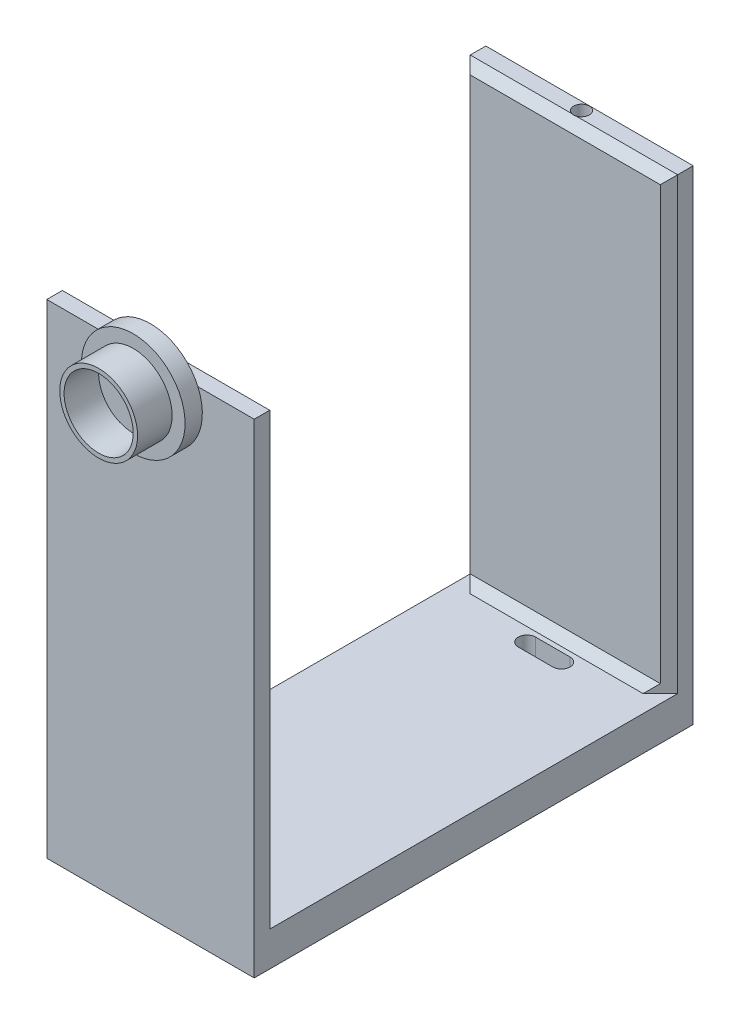
ISO-10303-21;
HEADER;
FILE_DESCRIPTION(('STEP AP214'),'2;1');
FILE_NAME('part.step','',(''),(''),'','','');
FILE_SCHEMA(('AUTOMOTIVE_DESIGN { 1 0 10303 214 1 1 1 1 }'));
ENDSEC;
DATA;
#1=APPLICATION_CONTEXT('core data for automotive mechanical design processes');
#2=APPLICATION_PROTOCOL_DEFINITION('international standard','automotive_design',2000,#1);
#3=PRODUCT_CONTEXT('',#1,'mechanical');
#4=PRODUCT('Part','Part','',(#3));
#5=PRODUCT_RELATED_PRODUCT_CATEGORY('part','',(#4));
#6=PRODUCT_DEFINITION_FORMATION('','',#4);
#7=PRODUCT_DEFINITION_CONTEXT('part definition',#1,'design');
#8=PRODUCT_DEFINITION('design','',#6,#7);
#9=PRODUCT_DEFINITION_SHAPE('','',#8);
#10=(LENGTH_UNIT() NAMED_UNIT(*) SI_UNIT(.MILLI.,.METRE.));
#11=(NAMED_UNIT(*) PLANE_ANGLE_UNIT() SI_UNIT($,.RADIAN.));
#12=(NAMED_UNIT(*) SI_UNIT($,.STERADIAN.) SOLID_ANGLE_UNIT());
#13=UNCERTAINTY_MEASURE_WITH_UNIT(LENGTH_MEASURE(1.E-05),#10,'distance_accuracy_value','');
#14=(GEOMETRIC_REPRESENTATION_CONTEXT(3) GLOBAL_UNCERTAINTY_ASSIGNED_CONTEXT((#13)) GLOBAL_UNIT_ASSIGNED_CONTEXT((#10,
#11,#12)) REPRESENTATION_CONTEXT('',''));
#15=CARTESIAN_POINT('',(0.,0.,0.));
#16=DIRECTION('',(0.,0.,1.));
#17=DIRECTION('',(1.,0.,0.));
#18=AXIS2_PLACEMENT_3D('',#15,#16,#17);
#19=CARTESIAN_POINT('',(6.,-2.,0.));
#20=DIRECTION('',(1.,0.,0.));
#21=DIRECTION('',(0.,0.,-1.));
#22=AXIS2_PLACEMENT_3D('',#19,#20,#21);
#23=PLANE('',#22);
#24=DIRECTION('',(0.,0.,1.));
#25=VECTOR('',#24,1.);
#26=CARTESIAN_POINT('',(6.,26.,-12.7));
#27=LINE('',#26,#25);
#28=CARTESIAN_POINT('',(6.,26.,-12.7));
#29=VERTEX_POINT('',#28);
#30=CARTESIAN_POINT('',(6.,26.,-11.8));
#31=VERTEX_POINT('',#30);
#32=EDGE_CURVE('E309',#29,#31,#27,.T.);
#33=ORIENTED_EDGE('',*,*,#32,.T.);
#34=DIRECTION('',(0.,-1.,0.));
#35=VECTOR('',#34,1.);
#36=CARTESIAN_POINT('',(6.,-2.,-11.8));
#37=LINE('',#36,#35);
#38=CARTESIAN_POINT('',(6.,0.,-11.8));
#39=VERTEX_POINT('',#38);
#40=EDGE_CURVE('E360',#31,#39,#37,.T.);
#41=ORIENTED_EDGE('',*,*,#40,.T.);
#42=DIRECTION('',(0.,0.,-1.));
#43=VECTOR('',#42,1.);
#44=CARTESIAN_POINT('',(6.,0.,0.));
#45=LINE('',#44,#43);
#46=CARTESIAN_POINT('',(6.,0.,11.8));
#47=VERTEX_POINT('',#46);
#48=EDGE_CURVE('E327',#47,#39,#45,.T.);
#49=ORIENTED_EDGE('',*,*,#48,.F.);
#50=DIRECTION('',(0.,1.,0.));
#51=VECTOR('',#50,1.);
#52=CARTESIAN_POINT('',(6.,26.,11.8));
#53=LINE('',#52,#51);
#54=CARTESIAN_POINT('',(6.,26.,11.8));
#55=VERTEX_POINT('',#54);
#56=EDGE_CURVE('E358',#47,#55,#53,.T.);
#57=ORIENTED_EDGE('',*,*,#56,.T.);
#58=DIRECTION('',(0.,0.,-1.));
#59=VECTOR('',#58,1.);
#60=CARTESIAN_POINT('',(6.,26.,12.7));
#61=LINE('',#60,#59);
#62=CARTESIAN_POINT('',(6.,26.,12.7));
#63=VERTEX_POINT('',#62);
#64=EDGE_CURVE('E325',#63,#55,#61,.T.);
#65=ORIENTED_EDGE('',*,*,#64,.F.);
#66=DIRECTION('',(0.,1.,0.));
#67=VECTOR('',#66,1.);
#68=CARTESIAN_POINT('',(6.,-2.,12.7));
#69=LINE('',#68,#67);
#70=CARTESIAN_POINT('',(6.,-2.,12.7));
#71=VERTEX_POINT('',#70);
#72=EDGE_CURVE('E218',#71,#63,#69,.T.);
#73=ORIENTED_EDGE('',*,*,#72,.F.);
#74=DIRECTION('',(0.,0.,-1.));
#75=VECTOR('',#74,1.);
#76=CARTESIAN_POINT('',(6.,-2.,0.));
#77=LINE('',#76,#75);
#78=CARTESIAN_POINT('',(6.,-2.,-12.7));
#79=VERTEX_POINT('',#78);
#80=EDGE_CURVE('E328',#71,#79,#77,.T.);
#81=ORIENTED_EDGE('',*,*,#80,.T.);
#82=DIRECTION('',(0.,1.,0.));
#83=VECTOR('',#82,1.);
#84=CARTESIAN_POINT('',(6.,-2.,-12.7));
#85=LINE('',#84,#83);
#86=EDGE_CURVE('E319',#79,#29,#85,.T.);
#87=ORIENTED_EDGE('',*,*,#86,.T.);
#88=EDGE_LOOP('',(#33,#41,#49,#57,#65,#73,#81,#87));
#89=FACE_BOUND('',#88,.T.);
#90=ADVANCED_FACE('F35',(#89),#23,.T.);
#91=CARTESIAN_POINT('',(-6.,-2.,12.7));
#92=DIRECTION('',(0.,0.,1.));
#93=DIRECTION('',(1.,0.,0.));
#94=AXIS2_PLACEMENT_3D('',#91,#92,#93);
#95=PLANE('',#94);
#96=CARTESIAN_POINT('',(0.,24.7857669326883,12.7));
#97=DIRECTION('',(0.,0.,1.));
#98=DIRECTION('',(1.,0.,0.));
#99=AXIS2_PLACEMENT_3D('',#96,#97,#98);
#100=CIRCLE('',#99,3.);
#101=CARTESIAN_POINT('',(-2.74328964169785,26.,12.7));
#102=VERTEX_POINT('',#101);
#103=CARTESIAN_POINT('',(2.74328964169785,26.,12.7));
#104=VERTEX_POINT('',#103);
#105=EDGE_CURVE('E45',#102,#104,#100,.T.);
#106=ORIENTED_EDGE('',*,*,#105,.F.);
#107=DIRECTION('',(1.,0.,0.));
#108=VECTOR('',#107,1.);
#109=CARTESIAN_POINT('',(-6.,26.,12.7));
#110=LINE('',#109,#108);
#111=CARTESIAN_POINT('',(-6.,26.,12.7));
#112=VERTEX_POINT('',#111);
#113=EDGE_CURVE('E211',#112,#102,#110,.T.);
#114=ORIENTED_EDGE('',*,*,#113,.F.);
#115=DIRECTION('',(0.,1.,0.));
#116=VECTOR('',#115,1.);
#117=CARTESIAN_POINT('',(-6.,-2.,12.7));
#118=LINE('',#117,#116);
#119=CARTESIAN_POINT('',(-6.,-2.,12.7));
#120=VERTEX_POINT('',#119);
#121=EDGE_CURVE('E336',#120,#112,#118,.T.);
#122=ORIENTED_EDGE('',*,*,#121,.F.);
#123=DIRECTION('',(1.,0.,0.));
#124=VECTOR('',#123,1.);
#125=CARTESIAN_POINT('',(-6.,-2.,12.7));
#126=LINE('',#125,#124);
#127=EDGE_CURVE('E334',#120,#71,#126,.T.);
#128=ORIENTED_EDGE('',*,*,#127,.T.);
#129=ORIENTED_EDGE('',*,*,#72,.T.);
#130=EDGE_CURVE('E209',#104,#63,#110,.T.);
#131=ORIENTED_EDGE('',*,*,#130,.F.);
#132=EDGE_LOOP('',(#106,#114,#122,#128,#129,#131));
#133=FACE_BOUND('',#132,.T.);
#134=ADVANCED_FACE('F216',(#133),#95,.T.);
#135=CARTESIAN_POINT('',(-6.,-2.,0.));
#136=DIRECTION('',(-1.,0.,0.));
#137=DIRECTION('',(0.,0.,1.));
#138=AXIS2_PLACEMENT_3D('',#135,#136,#137);
#139=PLANE('',#138);
#140=DIRECTION('',(0.,0.,1.));
#141=VECTOR('',#140,1.);
#142=CARTESIAN_POINT('',(-6.,0.,0.));
#143=LINE('',#142,#141);
#144=CARTESIAN_POINT('',(-6.,0.,-11.8));
#145=VERTEX_POINT('',#144);
#146=CARTESIAN_POINT('',(-6.,0.,11.8));
#147=VERTEX_POINT('',#146);
#148=EDGE_CURVE('E331',#145,#147,#143,.T.);
#149=ORIENTED_EDGE('',*,*,#148,.F.);
#150=DIRECTION('',(0.,1.,0.));
#151=VECTOR('',#150,1.);
#152=CARTESIAN_POINT('',(-6.,-2.,-11.8));
#153=LINE('',#152,#151);
#154=CARTESIAN_POINT('',(-6.,26.,-11.8));
#155=VERTEX_POINT('',#154);
#156=EDGE_CURVE('E352',#145,#155,#153,.T.);
#157=ORIENTED_EDGE('',*,*,#156,.T.);
#158=DIRECTION('',(0.,0.,-1.));
#159=VECTOR('',#158,1.);
#160=CARTESIAN_POINT('',(-6.,26.,-12.7));
#161=LINE('',#160,#159);
#162=CARTESIAN_POINT('',(-6.,26.,-12.7));
#163=VERTEX_POINT('',#162);
#164=EDGE_CURVE('E307',#155,#163,#161,.T.);
#165=ORIENTED_EDGE('',*,*,#164,.T.);
#166=DIRECTION('',(0.,1.,0.));
#167=VECTOR('',#166,1.);
#168=CARTESIAN_POINT('',(-6.,-2.,-12.7));
#169=LINE('',#168,#167);
#170=CARTESIAN_POINT('',(-6.,-2.,-12.7));
#171=VERTEX_POINT('',#170);
#172=EDGE_CURVE('E320',#171,#163,#169,.T.);
#173=ORIENTED_EDGE('',*,*,#172,.F.);
#174=DIRECTION('',(0.,0.,1.));
#175=VECTOR('',#174,1.);
#176=CARTESIAN_POINT('',(-6.,-2.,0.));
#177=LINE('',#176,#175);
#178=EDGE_CURVE('E330',#171,#120,#177,.T.);
#179=ORIENTED_EDGE('',*,*,#178,.T.);
#180=ORIENTED_EDGE('',*,*,#121,.T.);
#181=DIRECTION('',(0.,0.,1.));
#182=VECTOR('',#181,1.);
#183=CARTESIAN_POINT('',(-6.,26.,12.7));
#184=LINE('',#183,#182);
#185=CARTESIAN_POINT('',(-6.,26.,11.8));
#186=VERTEX_POINT('',#185);
#187=EDGE_CURVE('E220',#186,#112,#184,.T.);
#188=ORIENTED_EDGE('',*,*,#187,.F.);
#189=DIRECTION('',(0.,-1.,0.));
#190=VECTOR('',#189,1.);
#191=CARTESIAN_POINT('',(-6.,0.,11.8));
#192=LINE('',#191,#190);
#193=EDGE_CURVE('E349',#186,#147,#192,.T.);
#194=ORIENTED_EDGE('',*,*,#193,.T.);
#195=EDGE_LOOP('',(#149,#157,#165,#173,#179,#180,#188,#194));
#196=FACE_BOUND('',#195,.T.);
#197=ADVANCED_FACE('F447',(#196),#139,.T.);
#198=CARTESIAN_POINT('',(0.,-2.,0.));
#199=DIRECTION('',(0.,1.,0.));
#200=DIRECTION('',(0.,0.,1.));
#201=AXIS2_PLACEMENT_3D('',#198,#199,#200);
#202=PLANE('',#201);
#203=DIRECTION('',(-1.,0.,0.));
#204=VECTOR('',#203,1.);
#205=CARTESIAN_POINT('',(0.,-2.,-10.523894151716));
#206=LINE('',#205,#204);
#207=CARTESIAN_POINT('',(1.0560950117039,-2.,-10.523894151716));
#208=VERTEX_POINT('',#207);
#209=CARTESIAN_POINT('',(-0.944927115735066,-2.,-10.523894151716));
#210=VERTEX_POINT('',#209);
#211=EDGE_CURVE('E290',#208,#210,#206,.T.);
#212=ORIENTED_EDGE('',*,*,#211,.T.);
#213=CARTESIAN_POINT('',(-0.944927115735066,-2.,-10.023894151716));
#214=DIRECTION('',(0.,1.,0.));
#215=DIRECTION('',(0.,0.,1.));
#216=AXIS2_PLACEMENT_3D('',#213,#214,#215);
#217=CIRCLE('',#216,0.5);
#218=CARTESIAN_POINT('',(-0.944927115735066,-2.,-9.52389415171596));
#219=VERTEX_POINT('',#218);
#220=EDGE_CURVE('E293',#210,#219,#217,.T.);
#221=ORIENTED_EDGE('',*,*,#220,.T.);
#222=DIRECTION('',(1.,0.,0.));
#223=VECTOR('',#222,1.);
#224=CARTESIAN_POINT('',(0.,-2.,-9.52389415171596));
#225=LINE('',#224,#223);
#226=CARTESIAN_POINT('',(1.0560950117039,-2.,-9.52389415171596));
#227=VERTEX_POINT('',#226);
#228=EDGE_CURVE('E284',#219,#227,#225,.T.);
#229=ORIENTED_EDGE('',*,*,#228,.T.);
#230=CARTESIAN_POINT('',(1.0560950117039,-2.,-10.023894151716));
#231=DIRECTION('',(0.,1.,0.));
#232=DIRECTION('',(0.,0.,1.));
#233=AXIS2_PLACEMENT_3D('',#230,#231,#232);
#234=CIRCLE('',#233,0.5);
#235=EDGE_CURVE('E287',#227,#208,#234,.T.);
#236=ORIENTED_EDGE('',*,*,#235,.T.);
#237=EDGE_LOOP('',(#212,#221,#229,#236));
#238=FACE_BOUND('',#237,.T.);
#239=DIRECTION('',(-1.,0.,0.));
#240=VECTOR('',#239,1.);
#241=CARTESIAN_POINT('',(0.,-2.,9.52389415171596));
#242=LINE('',#241,#240);
#243=CARTESIAN_POINT('',(1.0560950117039,-2.,9.52389415171596));
#244=VERTEX_POINT('',#243);
#245=CARTESIAN_POINT('',(-0.944927115735066,-2.,9.52389415171596));
#246=VERTEX_POINT('',#245);
#247=EDGE_CURVE('E278',#244,#246,#242,.T.);
#248=ORIENTED_EDGE('',*,*,#247,.T.);
#249=CARTESIAN_POINT('',(-0.944927115735066,-2.,10.023894151716));
#250=DIRECTION('',(0.,1.,0.));
#251=DIRECTION('',(0.,0.,1.));
#252=AXIS2_PLACEMENT_3D('',#249,#250,#251);
#253=CIRCLE('',#252,0.5);
#254=CARTESIAN_POINT('',(-0.944927115735066,-2.,10.523894151716));
#255=VERTEX_POINT('',#254);
#256=EDGE_CURVE('E281',#246,#255,#253,.T.);
#257=ORIENTED_EDGE('',*,*,#256,.T.);
#258=DIRECTION('',(1.,0.,0.));
#259=VECTOR('',#258,1.);
#260=CARTESIAN_POINT('',(0.,-2.,10.523894151716));
#261=LINE('',#260,#259);
#262=CARTESIAN_POINT('',(1.0560950117039,-2.,10.523894151716));
#263=VERTEX_POINT('',#262);
#264=EDGE_CURVE('E249',#255,#263,#261,.T.);
#265=ORIENTED_EDGE('',*,*,#264,.T.);
#266=CARTESIAN_POINT('',(1.0560950117039,-2.,10.023894151716));
#267=DIRECTION('',(0.,1.,0.));
#268=DIRECTION('',(0.,0.,1.));
#269=AXIS2_PLACEMENT_3D('',#266,#267,#268);
#270=CIRCLE('',#269,0.5);
#271=EDGE_CURVE('E275',#263,#244,#270,.T.);
#272=ORIENTED_EDGE('',*,*,#271,.T.);
#273=EDGE_LOOP('',(#248,#257,#265,#272));
#274=FACE_BOUND('',#273,.T.);
#275=ORIENTED_EDGE('',*,*,#80,.F.);
#276=ORIENTED_EDGE('',*,*,#127,.F.);
#277=ORIENTED_EDGE('',*,*,#178,.F.);
#278=DIRECTION('',(1.,0.,0.));
#279=VECTOR('',#278,1.);
#280=CARTESIAN_POINT('',(-6.,-2.,-12.7));
#281=LINE('',#280,#279);
#282=EDGE_CURVE('E316',#171,#79,#281,.T.);
#283=ORIENTED_EDGE('',*,*,#282,.T.);
#284=EDGE_LOOP('',(#275,#276,#277,#283));
#285=FACE_BOUND('',#284,.T.);
#286=ADVANCED_FACE('F492',(#238,#274,#285),#202,.F.);
#287=CARTESIAN_POINT('',(0.,0.,0.));
#288=DIRECTION('',(0.,1.,0.));
#289=DIRECTION('',(0.,0.,1.));
#290=AXIS2_PLACEMENT_3D('',#287,#288,#289);
#291=PLANE('',#290);
#292=CARTESIAN_POINT('',(-0.944927115735066,0.,-10.023894151716));
#293=DIRECTION('',(0.,1.,0.));
#294=DIRECTION('',(0.,0.,1.));
#295=AXIS2_PLACEMENT_3D('',#292,#293,#294);
#296=CIRCLE('',#295,0.5);
#297=CARTESIAN_POINT('',(-0.944927115735066,0.,-10.523894151716));
#298=VERTEX_POINT('',#297);
#299=CARTESIAN_POINT('',(-0.944927115735066,0.,-9.52389415171596));
#300=VERTEX_POINT('',#299);
#301=EDGE_CURVE('E235',#298,#300,#296,.T.);
#302=ORIENTED_EDGE('',*,*,#301,.F.);
#303=DIRECTION('',(-1.,0.,0.));
#304=VECTOR('',#303,1.);
#305=CARTESIAN_POINT('',(-0.944927115735066,0.,-10.523894151716));
#306=LINE('',#305,#304);
#307=CARTESIAN_POINT('',(1.0560950117039,0.,-10.523894151716));
#308=VERTEX_POINT('',#307);
#309=EDGE_CURVE('E243',#308,#298,#306,.T.);
#310=ORIENTED_EDGE('',*,*,#309,.F.);
#311=CARTESIAN_POINT('',(1.0560950117039,0.,-10.023894151716));
#312=DIRECTION('',(0.,1.,0.));
#313=DIRECTION('',(0.,0.,1.));
#314=AXIS2_PLACEMENT_3D('',#311,#312,#313);
#315=CIRCLE('',#314,0.5);
#316=CARTESIAN_POINT('',(1.0560950117039,0.,-9.52389415171596));
#317=VERTEX_POINT('',#316);
#318=EDGE_CURVE('E240',#317,#308,#315,.T.);
#319=ORIENTED_EDGE('',*,*,#318,.F.);
#320=DIRECTION('',(1.,0.,0.));
#321=VECTOR('',#320,1.);
#322=CARTESIAN_POINT('',(-0.944927115735066,0.,-9.52389415171596));
#323=LINE('',#322,#321);
#324=EDGE_CURVE('E237',#300,#317,#323,.T.);
#325=ORIENTED_EDGE('',*,*,#324,.F.);
#326=EDGE_LOOP('',(#302,#310,#319,#325));
#327=FACE_BOUND('',#326,.T.);
#328=CARTESIAN_POINT('',(-0.944927115735066,0.,10.023894151716));
#329=DIRECTION('',(0.,1.,0.));
#330=DIRECTION('',(0.,0.,-1.));
#331=AXIS2_PLACEMENT_3D('',#328,#329,#330);
#332=CIRCLE('',#331,0.5);
#333=CARTESIAN_POINT('',(-0.944927115735066,0.,9.52389415171596));
#334=VERTEX_POINT('',#333);
#335=CARTESIAN_POINT('',(-0.944927115735066,0.,10.523894151716));
#336=VERTEX_POINT('',#335);
#337=EDGE_CURVE('E229',#334,#336,#332,.T.);
#338=ORIENTED_EDGE('',*,*,#337,.F.);
#339=DIRECTION('',(-1.,0.,0.));
#340=VECTOR('',#339,1.);
#341=CARTESIAN_POINT('',(-0.944927115735066,0.,9.52389415171596));
#342=LINE('',#341,#340);
#343=CARTESIAN_POINT('',(1.0560950117039,0.,9.52389415171596));
#344=VERTEX_POINT('',#343);
#345=EDGE_CURVE('E262',#344,#334,#342,.T.);
#346=ORIENTED_EDGE('',*,*,#345,.F.);
#347=CARTESIAN_POINT('',(1.0560950117039,0.,10.023894151716));
#348=DIRECTION('',(0.,1.,0.));
#349=DIRECTION('',(0.,0.,-1.));
#350=AXIS2_PLACEMENT_3D('',#347,#348,#349);
#351=CIRCLE('',#350,0.5);
#352=CARTESIAN_POINT('',(1.0560950117039,0.,10.523894151716));
#353=VERTEX_POINT('',#352);
#354=EDGE_CURVE('E259',#353,#344,#351,.T.);
#355=ORIENTED_EDGE('',*,*,#354,.F.);
#356=DIRECTION('',(1.,0.,0.));
#357=VECTOR('',#356,1.);
#358=CARTESIAN_POINT('',(-0.944927115735066,0.,10.523894151716));
#359=LINE('',#358,#357);
#360=EDGE_CURVE('E256',#336,#353,#359,.T.);
#361=ORIENTED_EDGE('',*,*,#360,.F.);
#362=EDGE_LOOP('',(#338,#346,#355,#361));
#363=FACE_BOUND('',#362,.T.);
#364=DIRECTION('',(0.70710678118655,0.,-0.707106781186545));
#365=VECTOR('',#364,1.);
#366=CARTESIAN_POINT('',(-6.,0.,11.8));
#367=LINE('',#366,#365);
#368=CARTESIAN_POINT('',(-4.99999999999999,0.,10.8));
#369=VERTEX_POINT('',#368);
#370=EDGE_CURVE('E381',#147,#369,#367,.T.);
#371=ORIENTED_EDGE('',*,*,#370,.T.);
#372=DIRECTION('',(1.,0.,0.));
#373=VECTOR('',#372,1.);
#374=CARTESIAN_POINT('',(0.,0.,10.8));
#375=LINE('',#374,#373);
#376=CARTESIAN_POINT('',(4.99999999999999,0.,10.8));
#377=VERTEX_POINT('',#376);
#378=EDGE_CURVE('E399',#369,#377,#375,.T.);
#379=ORIENTED_EDGE('',*,*,#378,.T.);
#380=DIRECTION('',(0.70710678118655,0.,0.707106781186545));
#381=VECTOR('',#380,1.);
#382=CARTESIAN_POINT('',(5.49999999999999,0.,11.3));
#383=LINE('',#382,#381);
#384=EDGE_CURVE('E378',#377,#47,#383,.T.);
#385=ORIENTED_EDGE('',*,*,#384,.T.);
#386=ORIENTED_EDGE('',*,*,#48,.T.);
#387=DIRECTION('',(0.70710678118655,0.,-0.707106781186545));
#388=VECTOR('',#387,1.);
#389=CARTESIAN_POINT('',(6.,0.,-11.8));
#390=LINE('',#389,#388);
#391=CARTESIAN_POINT('',(4.99999999999999,0.,-10.8));
#392=VERTEX_POINT('',#391);
#393=EDGE_CURVE('E376',#39,#392,#390,.F.);
#394=ORIENTED_EDGE('',*,*,#393,.T.);
#395=DIRECTION('',(-1.,0.,0.));
#396=VECTOR('',#395,1.);
#397=CARTESIAN_POINT('',(-5.5,0.,-10.8));
#398=LINE('',#397,#396);
#399=CARTESIAN_POINT('',(-4.99999999999999,0.,-10.8));
#400=VERTEX_POINT('',#399);
#401=EDGE_CURVE('E396',#392,#400,#398,.T.);
#402=ORIENTED_EDGE('',*,*,#401,.T.);
#403=DIRECTION('',(0.70710678118655,0.,0.707106781186545));
#404=VECTOR('',#403,1.);
#405=CARTESIAN_POINT('',(-5.5,0.,-11.3));
#406=LINE('',#405,#404);
#407=EDGE_CURVE('E373',#400,#145,#406,.F.);
#408=ORIENTED_EDGE('',*,*,#407,.T.);
#409=ORIENTED_EDGE('',*,*,#148,.T.);
#410=EDGE_LOOP('',(#371,#379,#385,#386,#394,#402,#408,#409));
#411=FACE_BOUND('',#410,.T.);
#412=ADVANCED_FACE('F460',(#327,#363,#411),#291,.T.);
#413=CARTESIAN_POINT('',(-6.,26.,11.3));
#414=DIRECTION('',(0.,0.,1.));
#415=DIRECTION('',(1.,0.,0.));
#416=AXIS2_PLACEMENT_3D('',#413,#414,#415);
#417=PLANE('',#416);
#418=DIRECTION('',(0.,-1.,0.));
#419=VECTOR('',#418,1.);
#420=CARTESIAN_POINT('',(5.49999999999999,0.,11.3));
#421=LINE('',#420,#419);
#422=CARTESIAN_POINT('',(5.49999999999999,25.5,11.3));
#423=VERTEX_POINT('',#422);
#424=CARTESIAN_POINT('',(5.49999999999999,0.5,11.3));
#425=VERTEX_POINT('',#424);
#426=EDGE_CURVE('E367',#423,#425,#421,.T.);
#427=ORIENTED_EDGE('',*,*,#426,.T.);
#428=DIRECTION('',(-1.,0.,0.));
#429=VECTOR('',#428,1.);
#430=CARTESIAN_POINT('',(-6.,0.5,11.3));
#431=LINE('',#430,#429);
#432=CARTESIAN_POINT('',(-5.49999999999999,0.5,11.3));
#433=VERTEX_POINT('',#432);
#434=EDGE_CURVE('E383',#425,#433,#431,.T.);
#435=ORIENTED_EDGE('',*,*,#434,.T.);
#436=DIRECTION('',(0.,1.,0.));
#437=VECTOR('',#436,1.);
#438=CARTESIAN_POINT('',(-5.49999999999999,26.,11.3));
#439=LINE('',#438,#437);
#440=CARTESIAN_POINT('',(-5.49999999999999,25.5,11.3));
#441=VERTEX_POINT('',#440);
#442=EDGE_CURVE('E363',#433,#441,#439,.T.);
#443=ORIENTED_EDGE('',*,*,#442,.T.);
#444=DIRECTION('',(1.,0.,0.));
#445=VECTOR('',#444,1.);
#446=CARTESIAN_POINT('',(-6.,25.5,11.3));
#447=LINE('',#446,#445);
#448=EDGE_CURVE('E365',#441,#423,#447,.T.);
#449=ORIENTED_EDGE('',*,*,#448,.T.);
#450=EDGE_LOOP('',(#427,#435,#443,#449));
#451=FACE_BOUND('',#450,.T.);
#452=ADVANCED_FACE('F484',(#451),#417,.F.);
#453=CARTESIAN_POINT('',(0.,26.,0.));
#454=DIRECTION('',(0.,-1.,0.));
#455=DIRECTION('',(0.,0.,-1.));
#456=AXIS2_PLACEMENT_3D('',#453,#454,#455);
#457=PLANE('',#456);
#458=DIRECTION('',(-1.,0.,0.));
#459=VECTOR('',#458,1.);
#460=CARTESIAN_POINT('',(0.,26.,11.8));
#461=LINE('',#460,#459);
#462=CARTESIAN_POINT('',(0.105569353476005,26.,11.8));
#463=VERTEX_POINT('',#462);
#464=EDGE_CURVE('E371',#55,#463,#461,.T.);
#465=ORIENTED_EDGE('',*,*,#464,.T.);
#466=CARTESIAN_POINT('',(0.,26.,12.2374415522177));
#467=DIRECTION('',(0.,1.,0.));
#468=DIRECTION('',(0.,0.,1.));
#469=AXIS2_PLACEMENT_3D('',#466,#467,#468);
#470=CIRCLE('',#469,0.45);
#471=CARTESIAN_POINT('',(-0.105569353476005,26.,11.8));
#472=VERTEX_POINT('',#471);
#473=EDGE_CURVE('E301',#472,#463,#470,.T.);
#474=ORIENTED_EDGE('',*,*,#473,.F.);
#475=EDGE_CURVE('E370',#472,#186,#461,.T.);
#476=ORIENTED_EDGE('',*,*,#475,.T.);
#477=ORIENTED_EDGE('',*,*,#187,.T.);
#478=ORIENTED_EDGE('',*,*,#113,.T.);
#479=EDGE_CURVE('E205',#102,#104,#110,.T.);
#480=ORIENTED_EDGE('',*,*,#479,.T.);
#481=ORIENTED_EDGE('',*,*,#130,.T.);
#482=ORIENTED_EDGE('',*,*,#64,.T.);
#483=EDGE_LOOP('',(#465,#474,#476,#477,#478,#480,#481,#482));
#484=FACE_BOUND('',#483,.T.);
#485=ADVANCED_FACE('F207',(#484),#457,.F.);
#486=CARTESIAN_POINT('',(-6.,-2.,-12.7));
#487=DIRECTION('',(0.,0.,1.));
#488=DIRECTION('',(1.,0.,0.));
#489=AXIS2_PLACEMENT_3D('',#486,#487,#488);
#490=PLANE('',#489);
#491=ORIENTED_EDGE('',*,*,#172,.T.);
#492=DIRECTION('',(1.,0.,0.));
#493=VECTOR('',#492,1.);
#494=CARTESIAN_POINT('',(-6.,26.,-12.7));
#495=LINE('',#494,#493);
#496=EDGE_CURVE('E313',#163,#29,#495,.T.);
#497=ORIENTED_EDGE('',*,*,#496,.T.);
#498=ORIENTED_EDGE('',*,*,#86,.F.);
#499=ORIENTED_EDGE('',*,*,#282,.F.);
#500=EDGE_LOOP('',(#491,#497,#498,#499));
#501=FACE_BOUND('',#500,.T.);
#502=ADVANCED_FACE('F443',(#501),#490,.F.);
#503=CARTESIAN_POINT('',(-6.,26.,-11.3));
#504=DIRECTION('',(0.,0.,1.));
#505=DIRECTION('',(1.,0.,0.));
#506=AXIS2_PLACEMENT_3D('',#503,#504,#505);
#507=PLANE('',#506);
#508=DIRECTION('',(0.,-1.,0.));
#509=VECTOR('',#508,1.);
#510=CARTESIAN_POINT('',(-5.5,26.,-11.3));
#511=LINE('',#510,#509);
#512=CARTESIAN_POINT('',(-5.5,25.5,-11.3));
#513=VERTEX_POINT('',#512);
#514=CARTESIAN_POINT('',(-5.5,0.499999999999997,-11.3));
#515=VERTEX_POINT('',#514);
#516=EDGE_CURVE('E346',#513,#515,#511,.T.);
#517=ORIENTED_EDGE('',*,*,#516,.T.);
#518=DIRECTION('',(1.,0.,0.));
#519=VECTOR('',#518,1.);
#520=CARTESIAN_POINT('',(5.5,0.499999999999997,-11.3));
#521=LINE('',#520,#519);
#522=CARTESIAN_POINT('',(5.5,0.499999999999997,-11.3));
#523=VERTEX_POINT('',#522);
#524=EDGE_CURVE('E402',#515,#523,#521,.T.);
#525=ORIENTED_EDGE('',*,*,#524,.T.);
#526=DIRECTION('',(0.,1.,0.));
#527=VECTOR('',#526,1.);
#528=CARTESIAN_POINT('',(5.5,26.,-11.3));
#529=LINE('',#528,#527);
#530=CARTESIAN_POINT('',(5.5,25.5,-11.3));
#531=VERTEX_POINT('',#530);
#532=EDGE_CURVE('E340',#523,#531,#529,.T.);
#533=ORIENTED_EDGE('',*,*,#532,.T.);
#534=DIRECTION('',(-1.,0.,0.));
#535=VECTOR('',#534,1.);
#536=CARTESIAN_POINT('',(-6.,25.5,-11.3));
#537=LINE('',#536,#535);
#538=EDGE_CURVE('E344',#531,#513,#537,.T.);
#539=ORIENTED_EDGE('',*,*,#538,.T.);
#540=EDGE_LOOP('',(#517,#525,#533,#539));
#541=FACE_BOUND('',#540,.T.);
#542=ADVANCED_FACE('F456',(#541),#507,.T.);
#543=CARTESIAN_POINT('',(0.,26.,0.));
#544=DIRECTION('',(0.,-1.,0.));
#545=DIRECTION('',(0.,0.,1.));
#546=AXIS2_PLACEMENT_3D('',#543,#544,#545);
#547=PLANE('',#546);
#548=DIRECTION('',(1.,0.,0.));
#549=VECTOR('',#548,1.);
#550=CARTESIAN_POINT('',(6.,26.,-11.8));
#551=LINE('',#550,#549);
#552=CARTESIAN_POINT('',(-0.105569353476009,26.,-11.8));
#553=VERTEX_POINT('',#552);
#554=EDGE_CURVE('E355',#155,#553,#551,.T.);
#555=ORIENTED_EDGE('',*,*,#554,.T.);
#556=CARTESIAN_POINT('',(0.,26.,-12.2374415522177));
#557=DIRECTION('',(0.,1.,0.));
#558=DIRECTION('',(0.,0.,-1.));
#559=AXIS2_PLACEMENT_3D('',#556,#557,#558);
#560=CIRCLE('',#559,0.45);
#561=CARTESIAN_POINT('',(0.105569353476002,26.,-11.8));
#562=VERTEX_POINT('',#561);
#563=EDGE_CURVE('E296',#562,#553,#560,.T.);
#564=ORIENTED_EDGE('',*,*,#563,.F.);
#565=EDGE_CURVE('E354',#562,#31,#551,.T.);
#566=ORIENTED_EDGE('',*,*,#565,.T.);
#567=ORIENTED_EDGE('',*,*,#32,.F.);
#568=ORIENTED_EDGE('',*,*,#496,.F.);
#569=ORIENTED_EDGE('',*,*,#164,.F.);
#570=EDGE_LOOP('',(#555,#564,#566,#567,#568,#569));
#571=FACE_BOUND('',#570,.T.);
#572=ADVANCED_FACE('F426',(#571),#547,.F.);
#573=CARTESIAN_POINT('',(6.,-2.,-11.8));
#574=DIRECTION('',(-0.707106781186545,0.,-0.70710678118655));
#575=DIRECTION('',(0.,-1.,0.));
#576=AXIS2_PLACEMENT_3D('',#573,#574,#575);
#577=PLANE('',#576);
#578=ORIENTED_EDGE('',*,*,#393,.F.);
#579=ORIENTED_EDGE('',*,*,#40,.F.);
#580=DIRECTION('',(0.577350269189627,0.577350269189627,-0.577350269189623));
#581=VECTOR('',#580,1.);
#582=CARTESIAN_POINT('',(-3.33333333333337,16.6666666666666,-2.46666666666669));
#583=LINE('',#582,#581);
#584=EDGE_CURVE('E310',#531,#31,#583,.T.);
#585=ORIENTED_EDGE('',*,*,#584,.F.);
#586=ORIENTED_EDGE('',*,*,#532,.F.);
#587=DIRECTION('',(-0.57735026918963,-0.577350269189622,0.577350269189626));
#588=VECTOR('',#587,1.);
#589=CARTESIAN_POINT('',(3.33333333333331,-1.66666666666666,-9.13333333333332));
#590=LINE('',#589,#588);
#591=EDGE_CURVE('E411',#523,#392,#590,.T.);
#592=ORIENTED_EDGE('',*,*,#591,.T.);
#593=EDGE_LOOP('',(#578,#579,#585,#586,#592));
#594=FACE_BOUND('',#593,.T.);
#595=ADVANCED_FACE('F437',(#594),#577,.F.);
#596=CARTESIAN_POINT('',(-6.,25.5,-11.3));
#597=DIRECTION('',(0.,0.707106781186545,0.70710678118655));
#598=DIRECTION('',(1.,0.,0.));
#599=AXIS2_PLACEMENT_3D('',#596,#597,#598);
#600=PLANE('',#599);
#601=CARTESIAN_POINT('',(0.,26.4374415522177,-12.2374415522177));
#602=DIRECTION('',(0.,0.707106781186545,0.70710678118655));
#603=DIRECTION('',(0.,0.70710678118655,-0.707106781186545));
#604=AXIS2_PLACEMENT_3D('',#601,#602,#603);
#605=ELLIPSE('',#604,0.636396103067896,0.45);
#606=EDGE_CURVE('E40',#553,#562,#605,.T.);
#607=ORIENTED_EDGE('',*,*,#606,.F.);
#608=ORIENTED_EDGE('',*,*,#554,.F.);
#609=DIRECTION('',(-0.577350269189627,0.577350269189627,-0.577350269189623));
#610=VECTOR('',#609,1.);
#611=CARTESIAN_POINT('',(-5.66666666666667,25.6666666666667,-11.4666666666667));
#612=LINE('',#611,#610);
#613=EDGE_CURVE('E384',#513,#155,#612,.T.);
#614=ORIENTED_EDGE('',*,*,#613,.F.);
#615=ORIENTED_EDGE('',*,*,#538,.F.);
#616=ORIENTED_EDGE('',*,*,#584,.T.);
#617=ORIENTED_EDGE('',*,*,#565,.F.);
#618=EDGE_LOOP('',(#607,#608,#614,#615,#616,#617));
#619=FACE_BOUND('',#618,.T.);
#620=ADVANCED_FACE('F429',(#619),#600,.T.);
#621=CARTESIAN_POINT('',(-5.5,26.,-11.3));
#622=DIRECTION('',(0.707106781186545,0.,-0.70710678118655));
#623=DIRECTION('',(0.,-1.,0.));
#624=AXIS2_PLACEMENT_3D('',#621,#622,#623);
#625=PLANE('',#624);
#626=ORIENTED_EDGE('',*,*,#613,.T.);
#627=ORIENTED_EDGE('',*,*,#156,.F.);
#628=ORIENTED_EDGE('',*,*,#407,.F.);
#629=DIRECTION('',(-0.57735026918963,0.577350269189622,-0.577350269189626));
#630=VECTOR('',#629,1.);
#631=CARTESIAN_POINT('',(-3.33333333333331,-1.66666666666666,-9.13333333333332));
#632=LINE('',#631,#630);
#633=EDGE_CURVE('E409',#400,#515,#632,.T.);
#634=ORIENTED_EDGE('',*,*,#633,.T.);
#635=ORIENTED_EDGE('',*,*,#516,.F.);
#636=EDGE_LOOP('',(#626,#627,#628,#634,#635));
#637=FACE_BOUND('',#636,.T.);
#638=ADVANCED_FACE('F452',(#637),#625,.F.);
#639=CARTESIAN_POINT('',(-6.,-2.,11.8));
#640=DIRECTION('',(-0.707106781186545,0.,-0.70710678118655));
#641=DIRECTION('',(0.,1.,0.));
#642=AXIS2_PLACEMENT_3D('',#639,#640,#641);
#643=PLANE('',#642);
#644=ORIENTED_EDGE('',*,*,#370,.F.);
#645=ORIENTED_EDGE('',*,*,#193,.F.);
#646=DIRECTION('',(-0.577350269189627,0.577350269189627,0.577350269189623));
#647=VECTOR('',#646,1.);
#648=CARTESIAN_POINT('',(3.33333333333337,16.6666666666666,2.46666666666669));
#649=LINE('',#648,#647);
#650=EDGE_CURVE('E387',#441,#186,#649,.T.);
#651=ORIENTED_EDGE('',*,*,#650,.F.);
#652=ORIENTED_EDGE('',*,*,#442,.F.);
#653=DIRECTION('',(0.577350269189627,-0.577350269189627,-0.577350269189623));
#654=VECTOR('',#653,1.);
#655=CARTESIAN_POINT('',(-5.66666666666666,0.666666666666669,11.4666666666667));
#656=LINE('',#655,#654);
#657=EDGE_CURVE('E404',#433,#369,#656,.T.);
#658=ORIENTED_EDGE('',*,*,#657,.T.);
#659=EDGE_LOOP('',(#644,#645,#651,#652,#658));
#660=FACE_BOUND('',#659,.T.);
#661=ADVANCED_FACE('F478',(#660),#643,.T.);
#662=CARTESIAN_POINT('',(0.,26.,11.8));
#663=DIRECTION('',(0.,-0.707106781186545,0.70710678118655));
#664=DIRECTION('',(-1.,0.,0.));
#665=AXIS2_PLACEMENT_3D('',#662,#663,#664);
#666=PLANE('',#665);
#667=CARTESIAN_POINT('',(0.,26.4374415522177,12.2374415522177));
#668=DIRECTION('',(0.,-0.707106781186545,0.70710678118655));
#669=DIRECTION('',(0.,0.70710678118655,0.707106781186545));
#670=AXIS2_PLACEMENT_3D('',#667,#668,#669);
#671=ELLIPSE('',#670,0.636396103067896,0.45);
#672=EDGE_CURVE('E413',#463,#472,#671,.F.);
#673=ORIENTED_EDGE('',*,*,#672,.F.);
#674=ORIENTED_EDGE('',*,*,#464,.F.);
#675=DIRECTION('',(0.577350269189627,0.577350269189627,0.577350269189623));
#676=VECTOR('',#675,1.);
#677=CARTESIAN_POINT('',(3.99999999999999,24.,9.8));
#678=LINE('',#677,#676);
#679=EDGE_CURVE('E300',#423,#55,#678,.T.);
#680=ORIENTED_EDGE('',*,*,#679,.F.);
#681=ORIENTED_EDGE('',*,*,#448,.F.);
#682=ORIENTED_EDGE('',*,*,#650,.T.);
#683=ORIENTED_EDGE('',*,*,#475,.F.);
#684=EDGE_LOOP('',(#673,#674,#680,#681,#682,#683));
#685=FACE_BOUND('',#684,.T.);
#686=ADVANCED_FACE('F470',(#685),#666,.F.);
#687=CARTESIAN_POINT('',(5.49999999999999,26.,11.3));
#688=DIRECTION('',(0.707106781186545,0.,-0.70710678118655));
#689=DIRECTION('',(0.,1.,0.));
#690=AXIS2_PLACEMENT_3D('',#687,#688,#689);
#691=PLANE('',#690);
#692=ORIENTED_EDGE('',*,*,#679,.T.);
#693=ORIENTED_EDGE('',*,*,#56,.F.);
#694=ORIENTED_EDGE('',*,*,#384,.F.);
#695=DIRECTION('',(0.577350269189627,0.577350269189627,0.577350269189623));
#696=VECTOR('',#695,1.);
#697=CARTESIAN_POINT('',(1.66666666666665,-3.33333333333335,7.46666666666668));
#698=LINE('',#697,#696);
#699=EDGE_CURVE('E407',#377,#425,#698,.T.);
#700=ORIENTED_EDGE('',*,*,#699,.T.);
#701=ORIENTED_EDGE('',*,*,#426,.F.);
#702=EDGE_LOOP('',(#692,#693,#694,#700,#701));
#703=FACE_BOUND('',#702,.T.);
#704=ADVANCED_FACE('F465',(#703),#691,.T.);
#705=CARTESIAN_POINT('',(-6.,0.5,11.3));
#706=DIRECTION('',(0.,-0.707106781186545,0.70710678118655));
#707=DIRECTION('',(-1.,0.,0.));
#708=AXIS2_PLACEMENT_3D('',#705,#706,#707);
#709=PLANE('',#708);
#710=ORIENTED_EDGE('',*,*,#699,.F.);
#711=ORIENTED_EDGE('',*,*,#378,.F.);
#712=ORIENTED_EDGE('',*,*,#657,.F.);
#713=ORIENTED_EDGE('',*,*,#434,.F.);
#714=EDGE_LOOP('',(#710,#711,#712,#713));
#715=FACE_BOUND('',#714,.T.);
#716=ADVANCED_FACE('F482',(#715),#709,.F.);
#717=CARTESIAN_POINT('',(0.,0.,-10.8));
#718=DIRECTION('',(0.,0.70710678118655,0.707106781186545));
#719=DIRECTION('',(1.,0.,0.));
#720=AXIS2_PLACEMENT_3D('',#717,#718,#719);
#721=PLANE('',#720);
#722=ORIENTED_EDGE('',*,*,#591,.F.);
#723=ORIENTED_EDGE('',*,*,#524,.F.);
#724=ORIENTED_EDGE('',*,*,#633,.F.);
#725=ORIENTED_EDGE('',*,*,#401,.F.);
#726=EDGE_LOOP('',(#722,#723,#724,#725));
#727=FACE_BOUND('',#726,.T.);
#728=ADVANCED_FACE('F38',(#727),#721,.T.);
#729=CARTESIAN_POINT('',(0.,21.,12.2374415522177));
#730=DIRECTION('',(0.,1.,0.));
#731=DIRECTION('',(0.,0.,1.));
#732=AXIS2_PLACEMENT_3D('',#729,#730,#731);
#733=CYLINDRICAL_SURFACE('',#732,0.45);
#734=ORIENTED_EDGE('',*,*,#672,.T.);
#735=ORIENTED_EDGE('',*,*,#473,.T.);
#736=EDGE_LOOP('',(#734,#735));
#737=FACE_BOUND('',#736,.T.);
#738=CARTESIAN_POINT('',(0.,21.,12.2374415522177));
#739=DIRECTION('',(0.,1.,0.));
#740=DIRECTION('',(0.,0.,1.));
#741=AXIS2_PLACEMENT_3D('',#738,#739,#740);
#742=CIRCLE('',#741,0.45);
#743=CARTESIAN_POINT('',(0.,21.,12.6874415522177));
#744=VERTEX_POINT('',#743);
#745=EDGE_CURVE('E297',#744,#744,#742,.T.);
#746=ORIENTED_EDGE('',*,*,#745,.F.);
#747=EDGE_LOOP('',(#746));
#748=FACE_BOUND('',#747,.T.);
#749=ADVANCED_FACE('F540',(#737,#748),#733,.F.);
#750=CARTESIAN_POINT('',(0.,21.,12.2374415522177));
#751=DIRECTION('',(0.,1.,0.));
#752=DIRECTION('',(0.,0.,1.));
#753=AXIS2_PLACEMENT_3D('',#750,#751,#752);
#754=PLANE('',#753);
#755=ORIENTED_EDGE('',*,*,#745,.T.);
#756=EDGE_LOOP('',(#755));
#757=FACE_BOUND('',#756,.T.);
#758=ADVANCED_FACE('F544',(#757),#754,.T.);
#759=CARTESIAN_POINT('',(0.,21.,-12.2374415522177));
#760=DIRECTION('',(0.,1.,0.));
#761=DIRECTION('',(0.,0.,1.));
#762=AXIS2_PLACEMENT_3D('',#759,#760,#761);
#763=CYLINDRICAL_SURFACE('',#762,0.45);
#764=ORIENTED_EDGE('',*,*,#606,.T.);
#765=ORIENTED_EDGE('',*,*,#563,.T.);
#766=EDGE_LOOP('',(#764,#765));
#767=FACE_BOUND('',#766,.T.);
#768=CARTESIAN_POINT('',(0.,21.,-12.2374415522177));
#769=DIRECTION('',(0.,1.,0.));
#770=DIRECTION('',(0.,0.,-1.));
#771=AXIS2_PLACEMENT_3D('',#768,#769,#770);
#772=CIRCLE('',#771,0.45);
#773=CARTESIAN_POINT('',(0.,21.,-12.6874415522177));
#774=VERTEX_POINT('',#773);
#775=EDGE_CURVE('E303',#774,#774,#772,.T.);
#776=ORIENTED_EDGE('',*,*,#775,.F.);
#777=EDGE_LOOP('',(#776));
#778=FACE_BOUND('',#777,.T.);
#779=ADVANCED_FACE('F420',(#767,#778),#763,.F.);
#780=CARTESIAN_POINT('',(0.,21.,-12.2374415522177));
#781=DIRECTION('',(0.,-1.,0.));
#782=DIRECTION('',(0.,0.,-1.));
#783=AXIS2_PLACEMENT_3D('',#780,#781,#782);
#784=PLANE('',#783);
#785=ORIENTED_EDGE('',*,*,#775,.T.);
#786=EDGE_LOOP('',(#785));
#787=FACE_BOUND('',#786,.T.);
#788=ADVANCED_FACE('F554',(#787),#784,.F.);
#789=CARTESIAN_POINT('',(-0.944927115735066,-5.,10.023894151716));
#790=DIRECTION('',(0.,1.,0.));
#791=DIRECTION('',(0.,0.,1.));
#792=AXIS2_PLACEMENT_3D('',#789,#790,#791);
#793=CYLINDRICAL_SURFACE('',#792,0.5);
#794=DIRECTION('',(0.,1.,0.));
#795=VECTOR('',#794,1.);
#796=CARTESIAN_POINT('',(-0.944927115735066,-5.,9.52389415171596));
#797=LINE('',#796,#795);
#798=EDGE_CURVE('E238',#246,#334,#797,.T.);
#799=ORIENTED_EDGE('',*,*,#798,.T.);
#800=ORIENTED_EDGE('',*,*,#337,.T.);
#801=DIRECTION('',(0.,1.,0.));
#802=VECTOR('',#801,1.);
#803=CARTESIAN_POINT('',(-0.944927115735066,-5.,10.523894151716));
#804=LINE('',#803,#802);
#805=EDGE_CURVE('E265',#255,#336,#804,.T.);
#806=ORIENTED_EDGE('',*,*,#805,.F.);
#807=ORIENTED_EDGE('',*,*,#256,.F.);
#808=EDGE_LOOP('',(#799,#800,#806,#807));
#809=FACE_BOUND('',#808,.T.);
#810=ADVANCED_FACE('F557',(#809),#793,.F.);
#811=CARTESIAN_POINT('',(-0.944927115735066,-5.,9.52389415171596));
#812=DIRECTION('',(0.,0.,-1.));
#813=DIRECTION('',(-1.,0.,0.));
#814=AXIS2_PLACEMENT_3D('',#811,#812,#813);
#815=PLANE('',#814);
#816=DIRECTION('',(0.,1.,0.));
#817=VECTOR('',#816,1.);
#818=CARTESIAN_POINT('',(1.0560950117039,-5.,9.52389415171596));
#819=LINE('',#818,#817);
#820=EDGE_CURVE('E267',#244,#344,#819,.T.);
#821=ORIENTED_EDGE('',*,*,#820,.T.);
#822=ORIENTED_EDGE('',*,*,#345,.T.);
#823=ORIENTED_EDGE('',*,*,#798,.F.);
#824=ORIENTED_EDGE('',*,*,#247,.F.);
#825=EDGE_LOOP('',(#821,#822,#823,#824));
#826=FACE_BOUND('',#825,.T.);
#827=ADVANCED_FACE('F640',(#826),#815,.F.);
#828=CARTESIAN_POINT('',(1.0560950117039,-5.,10.023894151716));
#829=DIRECTION('',(0.,1.,0.));
#830=DIRECTION('',(0.,0.,1.));
#831=AXIS2_PLACEMENT_3D('',#828,#829,#830);
#832=CYLINDRICAL_SURFACE('',#831,0.5);
#833=DIRECTION('',(0.,1.,0.));
#834=VECTOR('',#833,1.);
#835=CARTESIAN_POINT('',(1.0560950117039,-5.,10.523894151716));
#836=LINE('',#835,#834);
#837=EDGE_CURVE('E269',#263,#353,#836,.T.);
#838=ORIENTED_EDGE('',*,*,#837,.T.);
#839=ORIENTED_EDGE('',*,*,#354,.T.);
#840=ORIENTED_EDGE('',*,*,#820,.F.);
#841=ORIENTED_EDGE('',*,*,#271,.F.);
#842=EDGE_LOOP('',(#838,#839,#840,#841));
#843=FACE_BOUND('',#842,.T.);
#844=ADVANCED_FACE('F649',(#843),#832,.F.);
#845=CARTESIAN_POINT('',(-0.944927115735066,-5.,10.523894151716));
#846=DIRECTION('',(0.,0.,1.));
#847=DIRECTION('',(1.,0.,0.));
#848=AXIS2_PLACEMENT_3D('',#845,#846,#847);
#849=PLANE('',#848);
#850=ORIENTED_EDGE('',*,*,#805,.T.);
#851=ORIENTED_EDGE('',*,*,#360,.T.);
#852=ORIENTED_EDGE('',*,*,#837,.F.);
#853=ORIENTED_EDGE('',*,*,#264,.F.);
#854=EDGE_LOOP('',(#850,#851,#852,#853));
#855=FACE_BOUND('',#854,.T.);
#856=ADVANCED_FACE('F658',(#855),#849,.F.);
#857=CARTESIAN_POINT('',(-0.944927115735066,-5.,-10.023894151716));
#858=DIRECTION('',(0.,1.,0.));
#859=DIRECTION('',(0.,0.,1.));
#860=AXIS2_PLACEMENT_3D('',#857,#858,#859);
#861=CYLINDRICAL_SURFACE('',#860,0.5);
#862=DIRECTION('',(0.,1.,0.));
#863=VECTOR('',#862,1.);
#864=CARTESIAN_POINT('',(-0.944927115735066,-5.,-10.523894151716));
#865=LINE('',#864,#863);
#866=EDGE_CURVE('E247',#210,#298,#865,.T.);
#867=ORIENTED_EDGE('',*,*,#866,.T.);
#868=ORIENTED_EDGE('',*,*,#301,.T.);
#869=DIRECTION('',(0.,1.,0.));
#870=VECTOR('',#869,1.);
#871=CARTESIAN_POINT('',(-0.944927115735066,-5.,-9.52389415171596));
#872=LINE('',#871,#870);
#873=EDGE_CURVE('E246',#219,#300,#872,.T.);
#874=ORIENTED_EDGE('',*,*,#873,.F.);
#875=ORIENTED_EDGE('',*,*,#220,.F.);
#876=EDGE_LOOP('',(#867,#868,#874,#875));
#877=FACE_BOUND('',#876,.T.);
#878=ADVANCED_FACE('F667',(#877),#861,.F.);
#879=CARTESIAN_POINT('',(-0.944927115735066,-5.,-10.523894151716));
#880=DIRECTION('',(0.,0.,-1.));
#881=DIRECTION('',(-1.,0.,0.));
#882=AXIS2_PLACEMENT_3D('',#879,#880,#881);
#883=PLANE('',#882);
#884=DIRECTION('',(0.,1.,0.));
#885=VECTOR('',#884,1.);
#886=CARTESIAN_POINT('',(1.0560950117039,-5.,-10.523894151716));
#887=LINE('',#886,#885);
#888=EDGE_CURVE('E250',#208,#308,#887,.T.);
#889=ORIENTED_EDGE('',*,*,#888,.T.);
#890=ORIENTED_EDGE('',*,*,#309,.T.);
#891=ORIENTED_EDGE('',*,*,#866,.F.);
#892=ORIENTED_EDGE('',*,*,#211,.F.);
#893=EDGE_LOOP('',(#889,#890,#891,#892));
#894=FACE_BOUND('',#893,.T.);
#895=ADVANCED_FACE('F676',(#894),#883,.F.);
#896=CARTESIAN_POINT('',(1.0560950117039,-5.,-10.023894151716));
#897=DIRECTION('',(0.,1.,0.));
#898=DIRECTION('',(0.,0.,1.));
#899=AXIS2_PLACEMENT_3D('',#896,#897,#898);
#900=CYLINDRICAL_SURFACE('',#899,0.5);
#901=DIRECTION('',(0.,1.,0.));
#902=VECTOR('',#901,1.);
#903=CARTESIAN_POINT('',(1.0560950117039,-5.,-9.52389415171596));
#904=LINE('',#903,#902);
#905=EDGE_CURVE('E60',#227,#317,#904,.T.);
#906=ORIENTED_EDGE('',*,*,#905,.T.);
#907=ORIENTED_EDGE('',*,*,#318,.T.);
#908=ORIENTED_EDGE('',*,*,#888,.F.);
#909=ORIENTED_EDGE('',*,*,#235,.F.);
#910=EDGE_LOOP('',(#906,#907,#908,#909));
#911=FACE_BOUND('',#910,.T.);
#912=ADVANCED_FACE('F685',(#911),#900,.F.);
#913=CARTESIAN_POINT('',(-0.944927115735066,-5.,-9.52389415171596));
#914=DIRECTION('',(0.,0.,1.));
#915=DIRECTION('',(1.,0.,0.));
#916=AXIS2_PLACEMENT_3D('',#913,#914,#915);
#917=PLANE('',#916);
#918=ORIENTED_EDGE('',*,*,#873,.T.);
#919=ORIENTED_EDGE('',*,*,#324,.T.);
#920=ORIENTED_EDGE('',*,*,#905,.F.);
#921=ORIENTED_EDGE('',*,*,#228,.F.);
#922=EDGE_LOOP('',(#918,#919,#920,#921));
#923=FACE_BOUND('',#922,.T.);
#924=ADVANCED_FACE('F694',(#923),#917,.F.);
#925=CARTESIAN_POINT('',(0.,24.7857669326883,13.7));
#926=DIRECTION('',(0.,0.,-1.));
#927=DIRECTION('',(-1.,0.,0.));
#928=AXIS2_PLACEMENT_3D('',#925,#926,#927);
#929=CYLINDRICAL_SURFACE('',#928,3.);
#930=CARTESIAN_POINT('',(0.,24.7857669326883,13.7));
#931=DIRECTION('',(0.,0.,1.));
#932=DIRECTION('',(1.,0.,0.));
#933=AXIS2_PLACEMENT_3D('',#930,#931,#932);
#934=CIRCLE('',#933,3.);
#935=CARTESIAN_POINT('',(3.,24.7857669326883,13.7));
#936=VERTEX_POINT('',#935);
#937=EDGE_CURVE('E226',#936,#936,#934,.T.);
#938=ORIENTED_EDGE('',*,*,#937,.F.);
#939=EDGE_LOOP('',(#938));
#940=FACE_BOUND('',#939,.T.);
#941=EDGE_CURVE('E223',#104,#102,#100,.T.);
#942=ORIENTED_EDGE('',*,*,#941,.T.);
#943=ORIENTED_EDGE('',*,*,#105,.T.);
#944=EDGE_LOOP('',(#942,#943));
#945=FACE_BOUND('',#944,.T.);
#946=ADVANCED_FACE('F222',(#940,#945),#929,.T.);
#947=CARTESIAN_POINT('',(0.,24.7857669326883,13.7));
#948=DIRECTION('',(0.,0.,1.));
#949=DIRECTION('',(1.,0.,0.));
#950=AXIS2_PLACEMENT_3D('',#947,#948,#949);
#951=PLANE('',#950);
#952=CARTESIAN_POINT('',(0.,24.799373819161,13.7));
#953=DIRECTION('',(0.,0.,1.));
#954=DIRECTION('',(1.,0.,0.));
#955=AXIS2_PLACEMENT_3D('',#952,#953,#954);
#956=CIRCLE('',#955,2.25);
#957=CARTESIAN_POINT('',(2.25,24.799373819161,13.7));
#958=VERTEX_POINT('',#957);
#959=EDGE_CURVE('E11',#958,#958,#956,.T.);
#960=ORIENTED_EDGE('',*,*,#959,.F.);
#961=EDGE_LOOP('',(#960));
#962=FACE_BOUND('',#961,.T.);
#963=ORIENTED_EDGE('',*,*,#937,.T.);
#964=EDGE_LOOP('',(#963));
#965=FACE_BOUND('',#964,.T.);
#966=ADVANCED_FACE('F711',(#962,#965),#951,.T.);
#967=CARTESIAN_POINT('',(0.,24.7857669326883,12.7));
#968=DIRECTION('',(0.,0.,1.));
#969=DIRECTION('',(1.,0.,0.));
#970=AXIS2_PLACEMENT_3D('',#967,#968,#969);
#971=PLANE('',#970);
#972=ORIENTED_EDGE('',*,*,#479,.F.);
#973=ORIENTED_EDGE('',*,*,#941,.F.);
#974=EDGE_LOOP('',(#972,#973));
#975=FACE_BOUND('',#974,.T.);
#976=ADVANCED_FACE('F225',(#975),#971,.F.);
#977=CARTESIAN_POINT('',(0.,24.799373819161,15.7));
#978=DIRECTION('',(0.,0.,-1.));
#979=DIRECTION('',(-1.,0.,0.));
#980=AXIS2_PLACEMENT_3D('',#977,#978,#979);
#981=CYLINDRICAL_SURFACE('',#980,2.25);
#982=CARTESIAN_POINT('',(0.,24.799373819161,15.7));
#983=DIRECTION('',(0.,0.,1.));
#984=DIRECTION('',(1.,0.,0.));
#985=AXIS2_PLACEMENT_3D('',#982,#983,#984);
#986=CIRCLE('',#985,2.25);
#987=CARTESIAN_POINT('',(2.25,24.799373819161,15.7));
#988=VERTEX_POINT('',#987);
#989=EDGE_CURVE('E227',#988,#988,#986,.T.);
#990=ORIENTED_EDGE('',*,*,#989,.F.);
#991=EDGE_LOOP('',(#990));
#992=FACE_BOUND('',#991,.T.);
#993=ORIENTED_EDGE('',*,*,#959,.T.);
#994=EDGE_LOOP('',(#993));
#995=FACE_BOUND('',#994,.T.);
#996=ADVANCED_FACE('F729',(#992,#995),#981,.T.);
#997=CARTESIAN_POINT('',(0.,24.799373819161,15.7));
#998=DIRECTION('',(0.,0.,1.));
#999=DIRECTION('',(1.,0.,0.));
#1000=AXIS2_PLACEMENT_3D('',#997,#998,#999);
#1001=PLANE('',#1000);
#1002=CARTESIAN_POINT('',(0.,24.799373819161,15.7));
#1003=DIRECTION('',(0.,0.,1.));
#1004=DIRECTION('',(1.,0.,0.));
#1005=AXIS2_PLACEMENT_3D('',#1002,#1003,#1004);
#1006=CIRCLE('',#1005,2.);
#1007=CARTESIAN_POINT('',(2.,24.799373819161,15.7));
#1008=VERTEX_POINT('',#1007);
#1009=EDGE_CURVE('E785',#1008,#1008,#1006,.T.);
#1010=ORIENTED_EDGE('',*,*,#1009,.F.);
#1011=EDGE_LOOP('',(#1010));
#1012=FACE_BOUND('',#1011,.T.);
#1013=ORIENTED_EDGE('',*,*,#989,.T.);
#1014=EDGE_LOOP('',(#1013));
#1015=FACE_BOUND('',#1014,.T.);
#1016=ADVANCED_FACE('F736',(#1012,#1015),#1001,.T.);
#1017=CARTESIAN_POINT('',(0.,24.799373819161,13.7));
#1018=DIRECTION('',(0.,0.,1.));
#1019=DIRECTION('',(1.,0.,0.));
#1020=AXIS2_PLACEMENT_3D('',#1017,#1018,#1019);
#1021=CYLINDRICAL_SURFACE('',#1020,2.);
#1022=CARTESIAN_POINT('',(0.,24.799373819161,13.7));
#1023=DIRECTION('',(0.,0.,1.));
#1024=DIRECTION('',(1.,0.,0.));
#1025=AXIS2_PLACEMENT_3D('',#1022,#1023,#1024);
#1026=CIRCLE('',#1025,2.);
#1027=CARTESIAN_POINT('',(2.,24.799373819161,13.7));
#1028=VERTEX_POINT('',#1027);
#1029=EDGE_CURVE('E232',#1028,#1028,#1026,.T.);
#1030=ORIENTED_EDGE('',*,*,#1029,.F.);
#1031=EDGE_LOOP('',(#1030));
#1032=FACE_BOUND('',#1031,.T.);
#1033=ORIENTED_EDGE('',*,*,#1009,.T.);
#1034=EDGE_LOOP('',(#1033));
#1035=FACE_BOUND('',#1034,.T.);
#1036=ADVANCED_FACE('F745',(#1032,#1035),#1021,.F.);
#1037=CARTESIAN_POINT('',(0.,24.799373819161,13.7));
#1038=DIRECTION('',(0.,0.,1.));
#1039=DIRECTION('',(1.,0.,0.));
#1040=AXIS2_PLACEMENT_3D('',#1037,#1038,#1039);
#1041=PLANE('',#1040);
#1042=ORIENTED_EDGE('',*,*,#1029,.T.);
#1043=EDGE_LOOP('',(#1042));
#1044=FACE_BOUND('',#1043,.T.);
#1045=ADVANCED_FACE('F754',(#1044),#1041,.T.);
#1046=CLOSED_SHELL('',(#90,#134,#197,#286,#412,#452,#485,#502,#542,#572,#595,#620,#638,#661,
#686,#704,#716,#728,#749,#758,#779,#788,#810,#827,#844,#856,#878,#895,#912,#924,#946,#966,#976,
#996,#1016,#1036,#1045));
#1047=MANIFOLD_SOLID_BREP('B2',#1046);
#1048=ADVANCED_BREP_SHAPE_REPRESENTATION('',(#18,#1047),#14);
#1049=SHAPE_DEFINITION_REPRESENTATION(#9,#1048);
ENDSEC;
END-ISO-10303-21;
